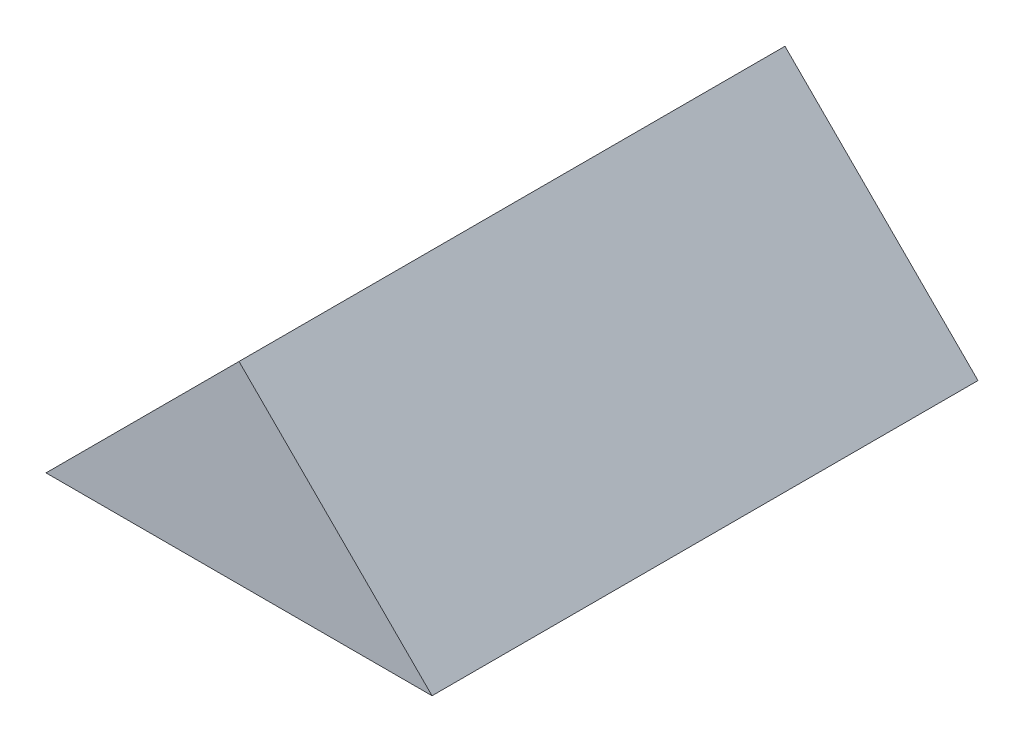
ISO-10303-21;
HEADER;
FILE_DESCRIPTION(('STEP AP214'),'2;1');
FILE_NAME('part.step','',(''),(''),'','','');
FILE_SCHEMA(('AUTOMOTIVE_DESIGN { 1 0 10303 214 1 1 1 1 }'));
ENDSEC;
DATA;
#1=APPLICATION_CONTEXT('core data for automotive mechanical design processes');
#2=APPLICATION_PROTOCOL_DEFINITION('international standard','automotive_design',2000,#1);
#3=PRODUCT_CONTEXT('',#1,'mechanical');
#4=PRODUCT('Part','Part','',(#3));
#5=PRODUCT_RELATED_PRODUCT_CATEGORY('part','',(#4));
#6=PRODUCT_DEFINITION_FORMATION('','',#4);
#7=PRODUCT_DEFINITION_CONTEXT('part definition',#1,'design');
#8=PRODUCT_DEFINITION('design','',#6,#7);
#9=PRODUCT_DEFINITION_SHAPE('','',#8);
#10=(LENGTH_UNIT() NAMED_UNIT(*) SI_UNIT(.MILLI.,.METRE.));
#11=(NAMED_UNIT(*) PLANE_ANGLE_UNIT() SI_UNIT($,.RADIAN.));
#12=(NAMED_UNIT(*) SI_UNIT($,.STERADIAN.) SOLID_ANGLE_UNIT());
#13=UNCERTAINTY_MEASURE_WITH_UNIT(LENGTH_MEASURE(1.E-05),#10,'distance_accuracy_value','');
#14=(GEOMETRIC_REPRESENTATION_CONTEXT(3) GLOBAL_UNCERTAINTY_ASSIGNED_CONTEXT((#13)) GLOBAL_UNIT_ASSIGNED_CONTEXT((#10,
#11,#12)) REPRESENTATION_CONTEXT('',''));
#15=CARTESIAN_POINT('',(0.,0.,0.));
#16=DIRECTION('',(0.,0.,1.));
#17=DIRECTION('',(1.,0.,0.));
#18=AXIS2_PLACEMENT_3D('',#15,#16,#17);
#19=CARTESIAN_POINT('',(-1.87050684918975E-13,17.960512242138,25.4));
#20=DIRECTION('',(0.707106781186544,-0.707106781186551,0.));
#21=DIRECTION('',(0.707106781186551,0.707106781186544,0.));
#22=AXIS2_PLACEMENT_3D('',#19,#20,#21);
#23=PLANE('',#22);
#24=DIRECTION('',(-0.707106781186551,-0.707106781186544,0.));
#25=VECTOR('',#24,1.);
#26=CARTESIAN_POINT('',(-1.87050684918975E-13,17.960512242138,-25.4));
#27=LINE('',#26,#25);
#28=CARTESIAN_POINT('',(-1.87050684918975E-13,17.960512242138,-25.4));
#29=VERTEX_POINT('',#28);
#30=CARTESIAN_POINT('',(-17.9605122421384,0.,-25.4));
#31=VERTEX_POINT('',#30);
#32=EDGE_CURVE('E80',#29,#31,#27,.T.);
#33=ORIENTED_EDGE('',*,*,#32,.T.);
#34=DIRECTION('',(0.,0.,-1.));
#35=VECTOR('',#34,1.);
#36=CARTESIAN_POINT('',(-17.9605122421384,0.,25.4));
#37=LINE('',#36,#35);
#38=CARTESIAN_POINT('',(-17.9605122421384,0.,25.4));
#39=VERTEX_POINT('',#38);
#40=EDGE_CURVE('E11',#39,#31,#37,.T.);
#41=ORIENTED_EDGE('',*,*,#40,.F.);
#42=DIRECTION('',(-0.707106781186551,-0.707106781186544,0.));
#43=VECTOR('',#42,1.);
#44=CARTESIAN_POINT('',(-1.87050684918975E-13,17.960512242138,25.4));
#45=LINE('',#44,#43);
#46=CARTESIAN_POINT('',(-1.87050684918975E-13,17.960512242138,25.4));
#47=VERTEX_POINT('',#46);
#48=EDGE_CURVE('E73',#47,#39,#45,.T.);
#49=ORIENTED_EDGE('',*,*,#48,.F.);
#50=DIRECTION('',(0.,0.,-1.));
#51=VECTOR('',#50,1.);
#52=CARTESIAN_POINT('',(-1.87050684918975E-13,17.960512242138,25.4));
#53=LINE('',#52,#51);
#54=EDGE_CURVE('E81',#47,#29,#53,.T.);
#55=ORIENTED_EDGE('',*,*,#54,.T.);
#56=EDGE_LOOP('',(#33,#41,#49,#55));
#57=FACE_BOUND('',#56,.T.);
#58=ADVANCED_FACE('F33',(#57),#23,.F.);
#59=CARTESIAN_POINT('',(-17.9605122421384,0.,25.4));
#60=DIRECTION('',(0.,1.,0.));
#61=DIRECTION('',(-1.,0.,0.));
#62=AXIS2_PLACEMENT_3D('',#59,#60,#61);
#63=PLANE('',#62);
#64=DIRECTION('',(1.,0.,0.));
#65=VECTOR('',#64,1.);
#66=CARTESIAN_POINT('',(-17.9605122421384,0.,-25.4));
#67=LINE('',#66,#65);
#68=CARTESIAN_POINT('',(17.9605122421384,0.,-25.4));
#69=VERTEX_POINT('',#68);
#70=EDGE_CURVE('E61',#31,#69,#67,.T.);
#71=ORIENTED_EDGE('',*,*,#70,.T.);
#72=DIRECTION('',(0.,0.,-1.));
#73=VECTOR('',#72,1.);
#74=CARTESIAN_POINT('',(17.9605122421384,0.,25.4));
#75=LINE('',#74,#73);
#76=CARTESIAN_POINT('',(17.9605122421384,0.,25.4));
#77=VERTEX_POINT('',#76);
#78=EDGE_CURVE('E41',#77,#69,#75,.T.);
#79=ORIENTED_EDGE('',*,*,#78,.F.);
#80=DIRECTION('',(1.,0.,0.));
#81=VECTOR('',#80,1.);
#82=CARTESIAN_POINT('',(-17.9605122421384,0.,25.4));
#83=LINE('',#82,#81);
#84=EDGE_CURVE('E69',#39,#77,#83,.T.);
#85=ORIENTED_EDGE('',*,*,#84,.F.);
#86=ORIENTED_EDGE('',*,*,#40,.T.);
#87=EDGE_LOOP('',(#71,#79,#85,#86));
#88=FACE_BOUND('',#87,.T.);
#89=ADVANCED_FACE('F70',(#88),#63,.F.);
#90=CARTESIAN_POINT('',(-1.87050684918975E-13,17.960512242138,25.4));
#91=DIRECTION('',(-0.707106781186536,-0.707106781186559,0.));
#92=DIRECTION('',(0.707106781186559,-0.707106781186536,0.));
#93=AXIS2_PLACEMENT_3D('',#90,#91,#92);
#94=PLANE('',#93);
#95=DIRECTION('',(-0.707106781186559,0.707106781186536,0.));
#96=VECTOR('',#95,1.);
#97=CARTESIAN_POINT('',(-1.87050684918975E-13,17.960512242138,-25.4));
#98=LINE('',#97,#96);
#99=EDGE_CURVE('E66',#69,#29,#98,.T.);
#100=ORIENTED_EDGE('',*,*,#99,.T.);
#101=ORIENTED_EDGE('',*,*,#54,.F.);
#102=DIRECTION('',(-0.707106781186559,0.707106781186536,0.));
#103=VECTOR('',#102,1.);
#104=CARTESIAN_POINT('',(-1.87050684918975E-13,17.960512242138,25.4));
#105=LINE('',#104,#103);
#106=EDGE_CURVE('E49',#77,#47,#105,.T.);
#107=ORIENTED_EDGE('',*,*,#106,.F.);
#108=ORIENTED_EDGE('',*,*,#78,.T.);
#109=EDGE_LOOP('',(#100,#101,#107,#108));
#110=FACE_BOUND('',#109,.T.);
#111=ADVANCED_FACE('F88',(#110),#94,.F.);
#112=CARTESIAN_POINT('',(0.,0.,25.4));
#113=DIRECTION('',(0.,0.,1.));
#114=DIRECTION('',(1.,0.,0.));
#115=AXIS2_PLACEMENT_3D('',#112,#113,#114);
#116=PLANE('',#115);
#117=ORIENTED_EDGE('',*,*,#48,.T.);
#118=ORIENTED_EDGE('',*,*,#84,.T.);
#119=ORIENTED_EDGE('',*,*,#106,.T.);
#120=EDGE_LOOP('',(#117,#118,#119));
#121=FACE_BOUND('',#120,.T.);
#122=ADVANCED_FACE('F76',(#121),#116,.T.);
#123=CARTESIAN_POINT('',(0.,0.,-25.4));
#124=DIRECTION('',(0.,0.,1.));
#125=DIRECTION('',(1.,0.,0.));
#126=AXIS2_PLACEMENT_3D('',#123,#124,#125);
#127=PLANE('',#126);
#128=ORIENTED_EDGE('',*,*,#32,.F.);
#129=ORIENTED_EDGE('',*,*,#99,.F.);
#130=ORIENTED_EDGE('',*,*,#70,.F.);
#131=EDGE_LOOP('',(#128,#129,#130));
#132=FACE_BOUND('',#131,.T.);
#133=ADVANCED_FACE('F89',(#132),#127,.F.);
#134=CLOSED_SHELL('',(#58,#89,#111,#122,#133));
#135=MANIFOLD_SOLID_BREP('B2',#134);
#136=ADVANCED_BREP_SHAPE_REPRESENTATION('',(#18,#135),#14);
#137=SHAPE_DEFINITION_REPRESENTATION(#9,#136);
ENDSEC;
END-ISO-10303-21;
